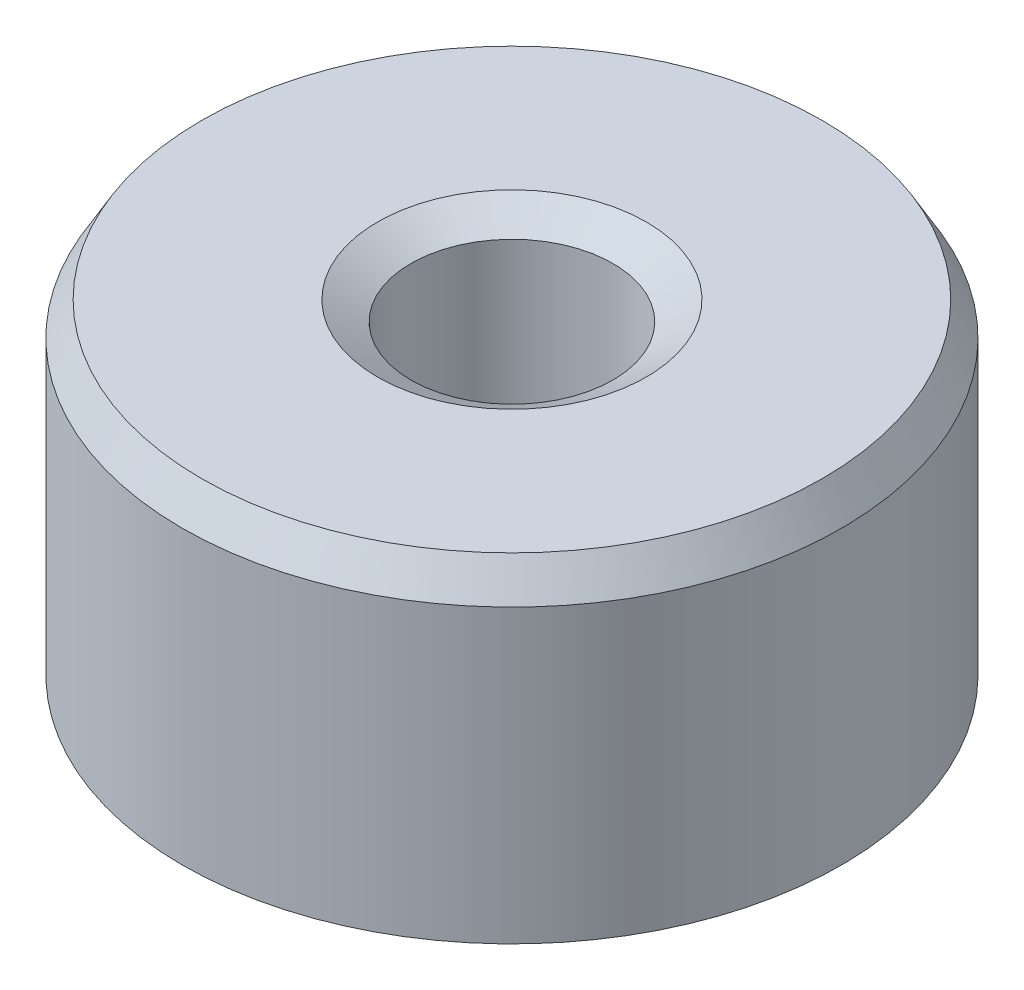
ISO-10303-21;
HEADER;
FILE_DESCRIPTION(('STEP AP214'),'2;1');
FILE_NAME('part.step','',(''),(''),'','','');
FILE_SCHEMA(('AUTOMOTIVE_DESIGN { 1 0 10303 214 1 1 1 1 }'));
ENDSEC;
DATA;
#1=APPLICATION_CONTEXT('core data for automotive mechanical design processes');
#2=APPLICATION_PROTOCOL_DEFINITION('international standard','automotive_design',2000,#1);
#3=PRODUCT_CONTEXT('',#1,'mechanical');
#4=PRODUCT('Part','Part','',(#3));
#5=PRODUCT_RELATED_PRODUCT_CATEGORY('part','',(#4));
#6=PRODUCT_DEFINITION_FORMATION('','',#4);
#7=PRODUCT_DEFINITION_CONTEXT('part definition',#1,'design');
#8=PRODUCT_DEFINITION('design','',#6,#7);
#9=PRODUCT_DEFINITION_SHAPE('','',#8);
#10=(LENGTH_UNIT() NAMED_UNIT(*) SI_UNIT(.MILLI.,.METRE.));
#11=(NAMED_UNIT(*) PLANE_ANGLE_UNIT() SI_UNIT($,.RADIAN.));
#12=(NAMED_UNIT(*) SI_UNIT($,.STERADIAN.) SOLID_ANGLE_UNIT());
#13=UNCERTAINTY_MEASURE_WITH_UNIT(LENGTH_MEASURE(1.E-05),#10,'distance_accuracy_value','');
#14=(GEOMETRIC_REPRESENTATION_CONTEXT(3) GLOBAL_UNCERTAINTY_ASSIGNED_CONTEXT((#13)) GLOBAL_UNIT_ASSIGNED_CONTEXT((#10,
#11,#12)) REPRESENTATION_CONTEXT('',''));
#15=CARTESIAN_POINT('',(0.,0.,0.));
#16=DIRECTION('',(0.,0.,1.));
#17=DIRECTION('',(1.,0.,0.));
#18=AXIS2_PLACEMENT_3D('',#15,#16,#17);
#19=CARTESIAN_POINT('',(0.,7.83520692874848,0.));
#20=DIRECTION('',(0.,-1.,0.));
#21=DIRECTION('',(0.,0.,-1.));
#22=AXIS2_PLACEMENT_3D('',#19,#20,#21);
#23=CYLINDRICAL_SURFACE('',#22,7.5);
#24=CARTESIAN_POINT('',(0.,0.438349934231822,0.));
#25=DIRECTION('',(0.,1.,0.));
#26=DIRECTION('',(0.,0.,1.));
#27=AXIS2_PLACEMENT_3D('',#24,#25,#26);
#28=CIRCLE('',#27,7.5);
#29=CARTESIAN_POINT('',(0.,0.438349934231822,7.5));
#30=VERTEX_POINT('',#29);
#31=EDGE_CURVE('E10',#30,#30,#28,.T.);
#32=ORIENTED_EDGE('',*,*,#31,.T.);
#33=EDGE_LOOP('',(#32));
#34=FACE_BOUND('',#33,.T.);
#35=CARTESIAN_POINT('',(0.,7.07596257116449,0.));
#36=DIRECTION('',(0.,1.,0.));
#37=DIRECTION('',(0.,0.,1.));
#38=AXIS2_PLACEMENT_3D('',#35,#36,#37);
#39=CIRCLE('',#38,7.5);
#40=CARTESIAN_POINT('',(0.,7.07596257116449,7.5));
#41=VERTEX_POINT('',#40);
#42=EDGE_CURVE('E50',#41,#41,#39,.F.);
#43=ORIENTED_EDGE('',*,*,#42,.T.);
#44=EDGE_LOOP('',(#43));
#45=FACE_BOUND('',#44,.T.);
#46=ADVANCED_FACE('F39',(#34,#45),#23,.T.);
#47=CARTESIAN_POINT('',(0.,7.83520692874848,0.));
#48=DIRECTION('',(0.,1.,0.));
#49=DIRECTION('',(0.,0.,1.));
#50=AXIS2_PLACEMENT_3D('',#47,#48,#49);
#51=PLANE('',#50);
#52=CARTESIAN_POINT('',(0.,7.83520692874848,0.));
#53=DIRECTION('',(0.,1.,0.));
#54=DIRECTION('',(0.,0.,1.));
#55=AXIS2_PLACEMENT_3D('',#52,#53,#54);
#56=CIRCLE('',#55,3.05854919027857);
#57=CARTESIAN_POINT('',(0.,7.83520692874848,3.05854919027857));
#58=VERTEX_POINT('',#57);
#59=EDGE_CURVE('E58',#58,#58,#56,.F.);
#60=ORIENTED_EDGE('',*,*,#59,.T.);
#61=EDGE_LOOP('',(#60));
#62=FACE_BOUND('',#61,.T.);
#63=CARTESIAN_POINT('',(0.,7.83520692874848,0.));
#64=DIRECTION('',(0.,1.,0.));
#65=DIRECTION('',(0.,0.,1.));
#66=AXIS2_PLACEMENT_3D('',#63,#64,#65);
#67=CIRCLE('',#66,7.06165006576818);
#68=CARTESIAN_POINT('',(0.,7.83520692874848,7.06165006576818));
#69=VERTEX_POINT('',#68);
#70=EDGE_CURVE('E61',#69,#69,#67,.T.);
#71=ORIENTED_EDGE('',*,*,#70,.T.);
#72=EDGE_LOOP('',(#71));
#73=FACE_BOUND('',#72,.T.);
#74=ADVANCED_FACE('F88',(#62,#73),#51,.T.);
#75=CARTESIAN_POINT('',(0.,0.,0.));
#76=DIRECTION('',(0.,1.,0.));
#77=DIRECTION('',(0.,0.,1.));
#78=AXIS2_PLACEMENT_3D('',#75,#76,#77);
#79=PLANE('',#78);
#80=CARTESIAN_POINT('',(0.,0.,0.));
#81=DIRECTION('',(0.,1.,0.));
#82=DIRECTION('',(0.,0.,1.));
#83=AXIS2_PLACEMENT_3D('',#80,#81,#82);
#84=CIRCLE('',#83,2.7376547669264);
#85=CARTESIAN_POINT('',(0.,0.,2.7376547669264));
#86=VERTEX_POINT('',#85);
#87=EDGE_CURVE('E51',#86,#86,#84,.T.);
#88=ORIENTED_EDGE('',*,*,#87,.T.);
#89=EDGE_LOOP('',(#88));
#90=FACE_BOUND('',#89,.T.);
#91=CARTESIAN_POINT('',(0.,0.,0.));
#92=DIRECTION('',(0.,1.,0.));
#93=DIRECTION('',(0.,0.,1.));
#94=AXIS2_PLACEMENT_3D('',#91,#92,#93);
#95=CIRCLE('',#94,6.740755642416);
#96=CARTESIAN_POINT('',(0.,0.,6.740755642416));
#97=VERTEX_POINT('',#96);
#98=EDGE_CURVE('E54',#97,#97,#95,.F.);
#99=ORIENTED_EDGE('',*,*,#98,.T.);
#100=EDGE_LOOP('',(#99));
#101=FACE_BOUND('',#100,.T.);
#102=ADVANCED_FACE('F83',(#90,#101),#79,.F.);
#103=CARTESIAN_POINT('',(0.,7.83520692874848,0.));
#104=DIRECTION('',(0.,-1.,0.));
#105=DIRECTION('',(0.,0.,-1.));
#106=AXIS2_PLACEMENT_3D('',#103,#104,#105);
#107=CYLINDRICAL_SURFACE('',#106,2.29930483269457);
#108=CARTESIAN_POINT('',(0.,7.39685699451666,0.));
#109=DIRECTION('',(0.,1.,0.));
#110=DIRECTION('',(0.,0.,1.));
#111=AXIS2_PLACEMENT_3D('',#108,#109,#110);
#112=CIRCLE('',#111,2.29930483269457);
#113=CARTESIAN_POINT('',(0.,7.39685699451666,2.29930483269457));
#114=VERTEX_POINT('',#113);
#115=EDGE_CURVE('E67',#114,#114,#112,.T.);
#116=ORIENTED_EDGE('',*,*,#115,.T.);
#117=EDGE_LOOP('',(#116));
#118=FACE_BOUND('',#117,.T.);
#119=CARTESIAN_POINT('',(0.,0.759244357584002,0.));
#120=DIRECTION('',(0.,1.,0.));
#121=DIRECTION('',(0.,0.,1.));
#122=AXIS2_PLACEMENT_3D('',#119,#120,#121);
#123=CIRCLE('',#122,2.29930483269457);
#124=CARTESIAN_POINT('',(0.,0.759244357584002,2.29930483269457));
#125=VERTEX_POINT('',#124);
#126=EDGE_CURVE('E69',#125,#125,#123,.F.);
#127=ORIENTED_EDGE('',*,*,#126,.T.);
#128=EDGE_LOOP('',(#127));
#129=FACE_BOUND('',#128,.T.);
#130=ADVANCED_FACE('F71',(#118,#129),#107,.F.);
#131=CARTESIAN_POINT('',(0.,7.39685699451666,0.));
#132=DIRECTION('',(0.,1.,0.));
#133=DIRECTION('',(0.,0.,1.));
#134=AXIS2_PLACEMENT_3D('',#131,#132,#133);
#135=CONICAL_SURFACE('',#134,2.29930483269457,1.0471975511966);
#136=ORIENTED_EDGE('',*,*,#59,.F.);
#137=EDGE_LOOP('',(#136));
#138=FACE_BOUND('',#137,.T.);
#139=ORIENTED_EDGE('',*,*,#115,.F.);
#140=EDGE_LOOP('',(#139));
#141=FACE_BOUND('',#140,.T.);
#142=ADVANCED_FACE('F77',(#138,#141),#135,.F.);
#143=CARTESIAN_POINT('',(0.,0.,0.));
#144=DIRECTION('',(0.,-1.,0.));
#145=DIRECTION('',(0.,0.,-1.));
#146=AXIS2_PLACEMENT_3D('',#143,#144,#145);
#147=CONICAL_SURFACE('',#146,2.7376547669264,0.523598775598296);
#148=ORIENTED_EDGE('',*,*,#126,.F.);
#149=EDGE_LOOP('',(#148));
#150=FACE_BOUND('',#149,.T.);
#151=ORIENTED_EDGE('',*,*,#87,.F.);
#152=EDGE_LOOP('',(#151));
#153=FACE_BOUND('',#152,.T.);
#154=ADVANCED_FACE('F73',(#150,#153),#147,.F.);
#155=CARTESIAN_POINT('',(0.,0.438349934231822,0.));
#156=DIRECTION('',(0.,1.,0.));
#157=DIRECTION('',(0.,0.,1.));
#158=AXIS2_PLACEMENT_3D('',#155,#156,#157);
#159=CONICAL_SURFACE('',#158,7.5,1.0471975511966);
#160=ORIENTED_EDGE('',*,*,#98,.F.);
#161=EDGE_LOOP('',(#160));
#162=FACE_BOUND('',#161,.T.);
#163=ORIENTED_EDGE('',*,*,#31,.F.);
#164=EDGE_LOOP('',(#163));
#165=FACE_BOUND('',#164,.T.);
#166=ADVANCED_FACE('F76',(#162,#165),#159,.T.);
#167=CARTESIAN_POINT('',(0.,7.83520692874848,0.));
#168=DIRECTION('',(0.,-1.,0.));
#169=DIRECTION('',(0.,0.,-1.));
#170=AXIS2_PLACEMENT_3D('',#167,#168,#169);
#171=CONICAL_SURFACE('',#170,7.06165006576818,0.523598775598292);
#172=ORIENTED_EDGE('',*,*,#42,.F.);
#173=EDGE_LOOP('',(#172));
#174=FACE_BOUND('',#173,.T.);
#175=ORIENTED_EDGE('',*,*,#70,.F.);
#176=EDGE_LOOP('',(#175));
#177=FACE_BOUND('',#176,.T.);
#178=ADVANCED_FACE('F45',(#174,#177),#171,.T.);
#179=CLOSED_SHELL('',(#46,#74,#102,#130,#142,#154,#166,#178));
#180=MANIFOLD_SOLID_BREP('B2',#179);
#181=ADVANCED_BREP_SHAPE_REPRESENTATION('',(#18,#180),#14);
#182=SHAPE_DEFINITION_REPRESENTATION(#9,#181);
ENDSEC;
END-ISO-10303-21;
